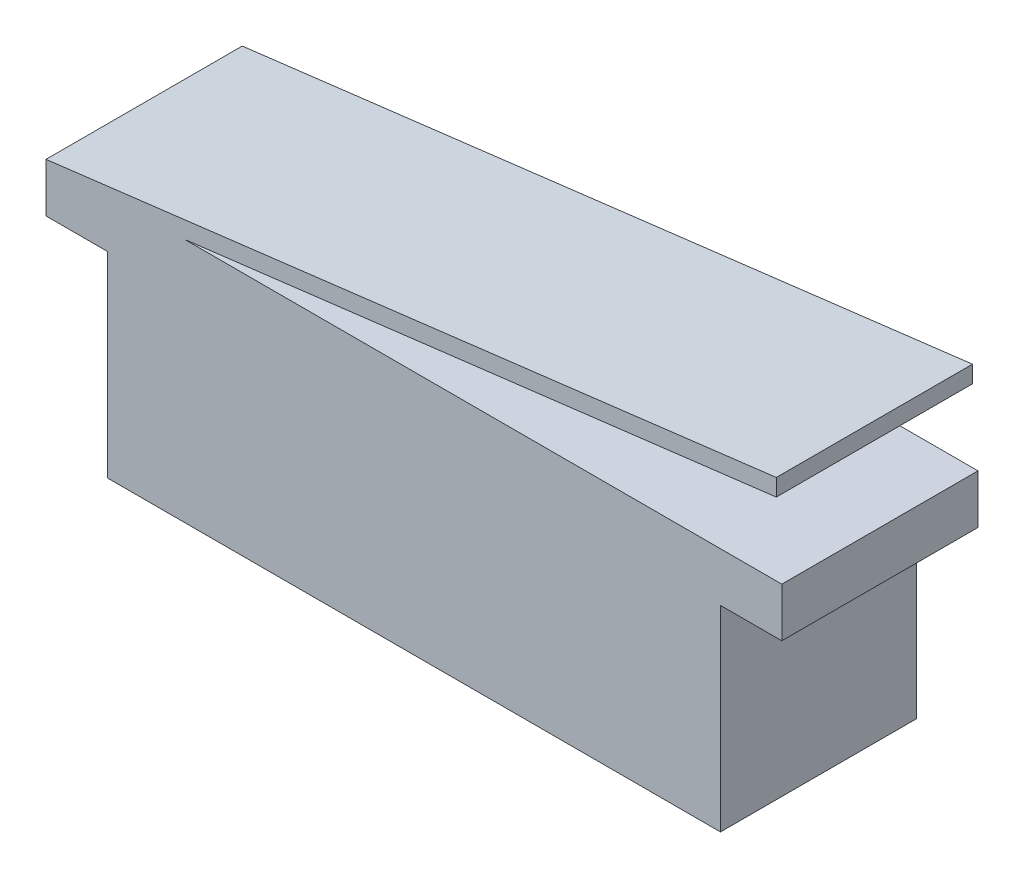
ISO-10303-21;
HEADER;
FILE_DESCRIPTION(('STEP AP214'),'2;1');
FILE_NAME('part.step','',(''),(''),'','','');
FILE_SCHEMA(('AUTOMOTIVE_DESIGN { 1 0 10303 214 1 1 1 1 }'));
ENDSEC;
DATA;
#1=APPLICATION_CONTEXT('core data for automotive mechanical design processes');
#2=APPLICATION_PROTOCOL_DEFINITION('international standard','automotive_design',2000,#1);
#3=PRODUCT_CONTEXT('',#1,'mechanical');
#4=PRODUCT('Part','Part','',(#3));
#5=PRODUCT_RELATED_PRODUCT_CATEGORY('part','',(#4));
#6=PRODUCT_DEFINITION_FORMATION('','',#4);
#7=PRODUCT_DEFINITION_CONTEXT('part definition',#1,'design');
#8=PRODUCT_DEFINITION('design','',#6,#7);
#9=PRODUCT_DEFINITION_SHAPE('','',#8);
#10=(LENGTH_UNIT() NAMED_UNIT(*) SI_UNIT(.MILLI.,.METRE.));
#11=(NAMED_UNIT(*) PLANE_ANGLE_UNIT() SI_UNIT($,.RADIAN.));
#12=(NAMED_UNIT(*) SI_UNIT($,.STERADIAN.) SOLID_ANGLE_UNIT());
#13=UNCERTAINTY_MEASURE_WITH_UNIT(LENGTH_MEASURE(1.E-05),#10,'distance_accuracy_value','');
#14=(GEOMETRIC_REPRESENTATION_CONTEXT(3) GLOBAL_UNCERTAINTY_ASSIGNED_CONTEXT((#13)) GLOBAL_UNIT_ASSIGNED_CONTEXT((#10,
#11,#12)) REPRESENTATION_CONTEXT('',''));
#15=CARTESIAN_POINT('',(0.,0.,0.));
#16=DIRECTION('',(0.,0.,1.));
#17=DIRECTION('',(1.,0.,0.));
#18=AXIS2_PLACEMENT_3D('',#15,#16,#17);
#19=CARTESIAN_POINT('',(14.7763845492397,0.,8.));
#20=DIRECTION('',(1.,0.,0.));
#21=DIRECTION('',(0.,0.,-1.));
#22=AXIS2_PLACEMENT_3D('',#19,#20,#21);
#23=PLANE('',#22);
#24=DIRECTION('',(0.,-1.,0.));
#25=VECTOR('',#24,1.);
#26=CARTESIAN_POINT('',(14.7763845492397,0.,0.));
#27=LINE('',#26,#25);
#28=CARTESIAN_POINT('',(14.7763845492397,9.65608030215444,0.));
#29=VERTEX_POINT('',#28);
#30=CARTESIAN_POINT('',(14.7763845492397,8.96187996174864,0.));
#31=VERTEX_POINT('',#30);
#32=EDGE_CURVE('E159',#29,#31,#27,.T.);
#33=ORIENTED_EDGE('',*,*,#32,.F.);
#34=DIRECTION('',(0.,0.,-1.));
#35=VECTOR('',#34,1.);
#36=CARTESIAN_POINT('',(14.7763845492397,9.65608030215444,8.));
#37=LINE('',#36,#35);
#38=CARTESIAN_POINT('',(14.7763845492397,9.65608030215444,8.));
#39=VERTEX_POINT('',#38);
#40=EDGE_CURVE('E11',#39,#29,#37,.T.);
#41=ORIENTED_EDGE('',*,*,#40,.F.);
#42=DIRECTION('',(0.,-1.,0.));
#43=VECTOR('',#42,1.);
#44=CARTESIAN_POINT('',(14.7763845492397,0.,8.));
#45=LINE('',#44,#43);
#46=CARTESIAN_POINT('',(14.7763845492397,8.96187996174864,8.));
#47=VERTEX_POINT('',#46);
#48=EDGE_CURVE('E194',#39,#47,#45,.T.);
#49=ORIENTED_EDGE('',*,*,#48,.T.);
#50=DIRECTION('',(0.,0.,-1.));
#51=VECTOR('',#50,1.);
#52=CARTESIAN_POINT('',(14.7763845492397,8.96187996174864,8.));
#53=LINE('',#52,#51);
#54=EDGE_CURVE('E103',#47,#31,#53,.T.);
#55=ORIENTED_EDGE('',*,*,#54,.T.);
#56=EDGE_LOOP('',(#33,#41,#49,#55));
#57=FACE_BOUND('',#56,.T.);
#58=ADVANCED_FACE('F43',(#57),#23,.T.);
#59=CARTESIAN_POINT('',(-0.948547739729034,7.7253013958255,8.));
#60=DIRECTION('',(-0.121869343405148,0.992546151641322,0.));
#61=DIRECTION('',(-0.992546151641322,-0.121869343405148,0.));
#62=AXIS2_PLACEMENT_3D('',#59,#60,#61);
#63=PLANE('',#62);
#64=DIRECTION('',(0.992546151641322,0.121869343405148,0.));
#65=VECTOR('',#64,1.);
#66=CARTESIAN_POINT('',(-0.948547739729034,7.7253013958255,0.));
#67=LINE('',#66,#65);
#68=CARTESIAN_POINT('',(-14.9999999999999,6.,0.));
#69=VERTEX_POINT('',#68);
#70=EDGE_CURVE('E163',#69,#29,#67,.T.);
#71=ORIENTED_EDGE('',*,*,#70,.F.);
#72=DIRECTION('',(0.,0.,-1.));
#73=VECTOR('',#72,1.);
#74=CARTESIAN_POINT('',(-14.9999999999999,6.,8.));
#75=LINE('',#74,#73);
#76=CARTESIAN_POINT('',(-14.9999999999999,6.,8.));
#77=VERTEX_POINT('',#76);
#78=EDGE_CURVE('E52',#77,#69,#75,.T.);
#79=ORIENTED_EDGE('',*,*,#78,.F.);
#80=DIRECTION('',(0.992546151641322,0.121869343405148,0.));
#81=VECTOR('',#80,1.);
#82=CARTESIAN_POINT('',(-0.948547739729034,7.7253013958255,8.));
#83=LINE('',#82,#81);
#84=EDGE_CURVE('E244',#77,#39,#83,.T.);
#85=ORIENTED_EDGE('',*,*,#84,.T.);
#86=ORIENTED_EDGE('',*,*,#40,.T.);
#87=EDGE_LOOP('',(#71,#79,#85,#86));
#88=FACE_BOUND('',#87,.T.);
#89=ADVANCED_FACE('F228',(#88),#63,.T.);
#90=CARTESIAN_POINT('',(-14.9999999999999,0.,8.));
#91=DIRECTION('',(-1.,0.,0.));
#92=DIRECTION('',(0.,0.,1.));
#93=AXIS2_PLACEMENT_3D('',#90,#91,#92);
#94=PLANE('',#93);
#95=DIRECTION('',(0.,1.,0.));
#96=VECTOR('',#95,1.);
#97=CARTESIAN_POINT('',(-14.9999999999999,0.,0.));
#98=LINE('',#97,#96);
#99=CARTESIAN_POINT('',(-14.9999999999999,4.,0.));
#100=VERTEX_POINT('',#99);
#101=EDGE_CURVE('E167',#100,#69,#98,.T.);
#102=ORIENTED_EDGE('',*,*,#101,.F.);
#103=DIRECTION('',(0.,0.,-1.));
#104=VECTOR('',#103,1.);
#105=CARTESIAN_POINT('',(-14.9999999999999,4.,8.));
#106=LINE('',#105,#104);
#107=CARTESIAN_POINT('',(-14.9999999999999,4.,8.));
#108=VERTEX_POINT('',#107);
#109=EDGE_CURVE('E215',#108,#100,#106,.T.);
#110=ORIENTED_EDGE('',*,*,#109,.F.);
#111=DIRECTION('',(0.,1.,0.));
#112=VECTOR('',#111,1.);
#113=CARTESIAN_POINT('',(-14.9999999999999,0.,8.));
#114=LINE('',#113,#112);
#115=EDGE_CURVE('E224',#108,#77,#114,.T.);
#116=ORIENTED_EDGE('',*,*,#115,.T.);
#117=ORIENTED_EDGE('',*,*,#78,.T.);
#118=EDGE_LOOP('',(#102,#110,#116,#117));
#119=FACE_BOUND('',#118,.T.);
#120=ADVANCED_FACE('F222',(#119),#94,.T.);
#121=CARTESIAN_POINT('',(0.,4.,8.));
#122=DIRECTION('',(0.,1.,0.));
#123=DIRECTION('',(0.,0.,1.));
#124=AXIS2_PLACEMENT_3D('',#121,#122,#123);
#125=PLANE('',#124);
#126=DIRECTION('',(1.,0.,0.));
#127=VECTOR('',#126,1.);
#128=CARTESIAN_POINT('',(0.,4.,0.));
#129=LINE('',#128,#127);
#130=CARTESIAN_POINT('',(-12.5,4.,0.));
#131=VERTEX_POINT('',#130);
#132=EDGE_CURVE('E171',#100,#131,#129,.T.);
#133=ORIENTED_EDGE('',*,*,#132,.T.);
#134=DIRECTION('',(0.,0.,-1.));
#135=VECTOR('',#134,1.);
#136=CARTESIAN_POINT('',(-12.5,4.,8.));
#137=LINE('',#136,#135);
#138=CARTESIAN_POINT('',(-12.5,4.,8.));
#139=VERTEX_POINT('',#138);
#140=EDGE_CURVE('E212',#139,#131,#137,.T.);
#141=ORIENTED_EDGE('',*,*,#140,.F.);
#142=DIRECTION('',(1.,0.,0.));
#143=VECTOR('',#142,1.);
#144=CARTESIAN_POINT('',(0.,4.,8.));
#145=LINE('',#144,#143);
#146=EDGE_CURVE('E239',#108,#139,#145,.T.);
#147=ORIENTED_EDGE('',*,*,#146,.F.);
#148=ORIENTED_EDGE('',*,*,#109,.T.);
#149=EDGE_LOOP('',(#133,#141,#147,#148));
#150=FACE_BOUND('',#149,.T.);
#151=ADVANCED_FACE('F236',(#150),#125,.F.);
#152=CARTESIAN_POINT('',(-12.5,0.,8.));
#153=DIRECTION('',(-1.,0.,0.));
#154=DIRECTION('',(0.,0.,1.));
#155=AXIS2_PLACEMENT_3D('',#152,#153,#154);
#156=PLANE('',#155);
#157=DIRECTION('',(0.,1.,0.));
#158=VECTOR('',#157,1.);
#159=CARTESIAN_POINT('',(-12.5,0.,0.));
#160=LINE('',#159,#158);
#161=CARTESIAN_POINT('',(-12.5,-4.,0.));
#162=VERTEX_POINT('',#161);
#163=EDGE_CURVE('E175',#162,#131,#160,.T.);
#164=ORIENTED_EDGE('',*,*,#163,.F.);
#165=DIRECTION('',(0.,0.,-1.));
#166=VECTOR('',#165,1.);
#167=CARTESIAN_POINT('',(-12.5,-4.,8.));
#168=LINE('',#167,#166);
#169=CARTESIAN_POINT('',(-12.5,-4.,8.));
#170=VERTEX_POINT('',#169);
#171=EDGE_CURVE('E209',#170,#162,#168,.T.);
#172=ORIENTED_EDGE('',*,*,#171,.F.);
#173=DIRECTION('',(0.,1.,0.));
#174=VECTOR('',#173,1.);
#175=CARTESIAN_POINT('',(-12.5,0.,8.));
#176=LINE('',#175,#174);
#177=EDGE_CURVE('E242',#170,#139,#176,.T.);
#178=ORIENTED_EDGE('',*,*,#177,.T.);
#179=ORIENTED_EDGE('',*,*,#140,.T.);
#180=EDGE_LOOP('',(#164,#172,#178,#179));
#181=FACE_BOUND('',#180,.T.);
#182=ADVANCED_FACE('F280',(#181),#156,.T.);
#183=CARTESIAN_POINT('',(0.,-4.,8.));
#184=DIRECTION('',(0.,1.,0.));
#185=DIRECTION('',(0.,0.,1.));
#186=AXIS2_PLACEMENT_3D('',#183,#184,#185);
#187=PLANE('',#186);
#188=DIRECTION('',(1.,0.,0.));
#189=VECTOR('',#188,1.);
#190=CARTESIAN_POINT('',(0.,-4.,0.));
#191=LINE('',#190,#189);
#192=CARTESIAN_POINT('',(12.5000000000001,-4.,0.));
#193=VERTEX_POINT('',#192);
#194=EDGE_CURVE('E180',#162,#193,#191,.T.);
#195=ORIENTED_EDGE('',*,*,#194,.T.);
#196=DIRECTION('',(0.,0.,-1.));
#197=VECTOR('',#196,1.);
#198=CARTESIAN_POINT('',(12.5000000000001,-4.,8.));
#199=LINE('',#198,#197);
#200=CARTESIAN_POINT('',(12.5000000000001,-4.,8.));
#201=VERTEX_POINT('',#200);
#202=EDGE_CURVE('E205',#201,#193,#199,.T.);
#203=ORIENTED_EDGE('',*,*,#202,.F.);
#204=DIRECTION('',(1.,0.,0.));
#205=VECTOR('',#204,1.);
#206=CARTESIAN_POINT('',(0.,-4.,8.));
#207=LINE('',#206,#205);
#208=EDGE_CURVE('E253',#170,#201,#207,.T.);
#209=ORIENTED_EDGE('',*,*,#208,.F.);
#210=ORIENTED_EDGE('',*,*,#171,.T.);
#211=EDGE_LOOP('',(#195,#203,#209,#210));
#212=FACE_BOUND('',#211,.T.);
#213=ADVANCED_FACE('F283',(#212),#187,.F.);
#214=CARTESIAN_POINT('',(12.5000000000001,0.,8.));
#215=DIRECTION('',(-1.,0.,0.));
#216=DIRECTION('',(0.,0.,1.));
#217=AXIS2_PLACEMENT_3D('',#214,#215,#216);
#218=PLANE('',#217);
#219=DIRECTION('',(0.,1.,0.));
#220=VECTOR('',#219,1.);
#221=CARTESIAN_POINT('',(12.5000000000001,0.,0.));
#222=LINE('',#221,#220);
#223=CARTESIAN_POINT('',(12.5000000000001,4.,0.));
#224=VERTEX_POINT('',#223);
#225=EDGE_CURVE('E183',#193,#224,#222,.T.);
#226=ORIENTED_EDGE('',*,*,#225,.T.);
#227=DIRECTION('',(0.,0.,-1.));
#228=VECTOR('',#227,1.);
#229=CARTESIAN_POINT('',(12.5000000000001,4.,8.));
#230=LINE('',#229,#228);
#231=CARTESIAN_POINT('',(12.5000000000001,4.,8.));
#232=VERTEX_POINT('',#231);
#233=EDGE_CURVE('E201',#232,#224,#230,.T.);
#234=ORIENTED_EDGE('',*,*,#233,.F.);
#235=DIRECTION('',(0.,1.,0.));
#236=VECTOR('',#235,1.);
#237=CARTESIAN_POINT('',(12.5000000000001,0.,8.));
#238=LINE('',#237,#236);
#239=EDGE_CURVE('E255',#201,#232,#238,.T.);
#240=ORIENTED_EDGE('',*,*,#239,.F.);
#241=ORIENTED_EDGE('',*,*,#202,.T.);
#242=EDGE_LOOP('',(#226,#234,#240,#241));
#243=FACE_BOUND('',#242,.T.);
#244=ADVANCED_FACE('F263',(#243),#218,.F.);
#245=CARTESIAN_POINT('',(15.0000000000001,4.,0.));
#246=VERTEX_POINT('',#245);
#247=EDGE_CURVE('E176',#224,#246,#129,.T.);
#248=ORIENTED_EDGE('',*,*,#247,.T.);
#249=DIRECTION('',(0.,0.,-1.));
#250=VECTOR('',#249,1.);
#251=CARTESIAN_POINT('',(15.0000000000001,4.,8.));
#252=LINE('',#251,#250);
#253=CARTESIAN_POINT('',(15.0000000000001,4.,8.));
#254=VERTEX_POINT('',#253);
#255=EDGE_CURVE('E150',#254,#246,#252,.T.);
#256=ORIENTED_EDGE('',*,*,#255,.F.);
#257=EDGE_CURVE('E135',#232,#254,#145,.T.);
#258=ORIENTED_EDGE('',*,*,#257,.F.);
#259=ORIENTED_EDGE('',*,*,#233,.T.);
#260=EDGE_LOOP('',(#248,#256,#258,#259));
#261=FACE_BOUND('',#260,.T.);
#262=ADVANCED_FACE('F267',(#261),#125,.F.);
#263=CARTESIAN_POINT('',(15.0000000000001,0.,8.));
#264=DIRECTION('',(-1.,0.,0.));
#265=DIRECTION('',(0.,0.,1.));
#266=AXIS2_PLACEMENT_3D('',#263,#264,#265);
#267=PLANE('',#266);
#268=DIRECTION('',(0.,1.,0.));
#269=VECTOR('',#268,1.);
#270=CARTESIAN_POINT('',(15.0000000000001,0.,0.));
#271=LINE('',#270,#269);
#272=CARTESIAN_POINT('',(15.0000000000001,6.,0.));
#273=VERTEX_POINT('',#272);
#274=EDGE_CURVE('E145',#246,#273,#271,.T.);
#275=ORIENTED_EDGE('',*,*,#274,.T.);
#276=DIRECTION('',(0.,0.,-1.));
#277=VECTOR('',#276,1.);
#278=CARTESIAN_POINT('',(15.0000000000001,6.,8.));
#279=LINE('',#278,#277);
#280=CARTESIAN_POINT('',(15.0000000000001,6.,8.));
#281=VERTEX_POINT('',#280);
#282=EDGE_CURVE('E142',#281,#273,#279,.T.);
#283=ORIENTED_EDGE('',*,*,#282,.F.);
#284=DIRECTION('',(0.,1.,0.));
#285=VECTOR('',#284,1.);
#286=CARTESIAN_POINT('',(15.0000000000001,0.,8.));
#287=LINE('',#286,#285);
#288=EDGE_CURVE('E129',#254,#281,#287,.T.);
#289=ORIENTED_EDGE('',*,*,#288,.F.);
#290=ORIENTED_EDGE('',*,*,#255,.T.);
#291=EDGE_LOOP('',(#275,#283,#289,#290));
#292=FACE_BOUND('',#291,.T.);
#293=ADVANCED_FACE('F143',(#292),#267,.F.);
#294=CARTESIAN_POINT('',(0.,6.,8.));
#295=DIRECTION('',(0.,1.,0.));
#296=DIRECTION('',(0.,0.,1.));
#297=AXIS2_PLACEMENT_3D('',#294,#295,#296);
#298=PLANE('',#297);
#299=DIRECTION('',(1.,0.,0.));
#300=VECTOR('',#299,1.);
#301=CARTESIAN_POINT('',(0.,6.,0.));
#302=LINE('',#301,#300);
#303=CARTESIAN_POINT('',(-9.34619193731727,6.,0.));
#304=VERTEX_POINT('',#303);
#305=EDGE_CURVE('E188',#304,#273,#302,.T.);
#306=ORIENTED_EDGE('',*,*,#305,.F.);
#307=DIRECTION('',(0.,0.,-1.));
#308=VECTOR('',#307,1.);
#309=CARTESIAN_POINT('',(-9.34619193731727,6.,8.));
#310=LINE('',#309,#308);
#311=CARTESIAN_POINT('',(-9.34619193731727,6.,8.));
#312=VERTEX_POINT('',#311);
#313=EDGE_CURVE('E96',#312,#304,#310,.T.);
#314=ORIENTED_EDGE('',*,*,#313,.F.);
#315=DIRECTION('',(1.,0.,0.));
#316=VECTOR('',#315,1.);
#317=CARTESIAN_POINT('',(0.,6.,8.));
#318=LINE('',#317,#316);
#319=EDGE_CURVE('E133',#312,#281,#318,.T.);
#320=ORIENTED_EDGE('',*,*,#319,.T.);
#321=ORIENTED_EDGE('',*,*,#282,.T.);
#322=EDGE_LOOP('',(#306,#314,#320,#321));
#323=FACE_BOUND('',#322,.T.);
#324=ADVANCED_FACE('F152',(#323),#298,.T.);
#325=CARTESIAN_POINT('',(-0.86457660859058,7.04141141388505,8.));
#326=DIRECTION('',(-0.121869343405148,0.992546151641322,0.));
#327=DIRECTION('',(-0.992546151641322,-0.121869343405148,0.));
#328=AXIS2_PLACEMENT_3D('',#325,#326,#327);
#329=PLANE('',#328);
#330=DIRECTION('',(0.992546151641322,0.121869343405148,0.));
#331=VECTOR('',#330,1.);
#332=CARTESIAN_POINT('',(-0.86457660859058,7.04141141388505,0.));
#333=LINE('',#332,#331);
#334=EDGE_CURVE('E191',#304,#31,#333,.T.);
#335=ORIENTED_EDGE('',*,*,#334,.T.);
#336=ORIENTED_EDGE('',*,*,#54,.F.);
#337=DIRECTION('',(0.992546151641322,0.121869343405148,0.));
#338=VECTOR('',#337,1.);
#339=CARTESIAN_POINT('',(-0.86457660859058,7.04141141388505,8.));
#340=LINE('',#339,#338);
#341=EDGE_CURVE('E60',#312,#47,#340,.T.);
#342=ORIENTED_EDGE('',*,*,#341,.F.);
#343=ORIENTED_EDGE('',*,*,#313,.T.);
#344=EDGE_LOOP('',(#335,#336,#342,#343));
#345=FACE_BOUND('',#344,.T.);
#346=ADVANCED_FACE('F268',(#345),#329,.F.);
#347=CARTESIAN_POINT('',(0.,0.,8.));
#348=DIRECTION('',(0.,0.,1.));
#349=DIRECTION('',(1.,0.,0.));
#350=AXIS2_PLACEMENT_3D('',#347,#348,#349);
#351=PLANE('',#350);
#352=ORIENTED_EDGE('',*,*,#48,.F.);
#353=ORIENTED_EDGE('',*,*,#84,.F.);
#354=ORIENTED_EDGE('',*,*,#115,.F.);
#355=ORIENTED_EDGE('',*,*,#146,.T.);
#356=ORIENTED_EDGE('',*,*,#177,.F.);
#357=ORIENTED_EDGE('',*,*,#208,.T.);
#358=ORIENTED_EDGE('',*,*,#239,.T.);
#359=ORIENTED_EDGE('',*,*,#257,.T.);
#360=ORIENTED_EDGE('',*,*,#288,.T.);
#361=ORIENTED_EDGE('',*,*,#319,.F.);
#362=ORIENTED_EDGE('',*,*,#341,.T.);
#363=EDGE_LOOP('',(#352,#353,#354,#355,#356,#357,#358,#359,#360,#361,#362));
#364=FACE_BOUND('',#363,.T.);
#365=ADVANCED_FACE('F131',(#364),#351,.T.);
#366=CARTESIAN_POINT('',(0.,0.,0.));
#367=DIRECTION('',(0.,0.,1.));
#368=DIRECTION('',(1.,0.,0.));
#369=AXIS2_PLACEMENT_3D('',#366,#367,#368);
#370=PLANE('',#369);
#371=ORIENTED_EDGE('',*,*,#32,.T.);
#372=ORIENTED_EDGE('',*,*,#334,.F.);
#373=ORIENTED_EDGE('',*,*,#305,.T.);
#374=ORIENTED_EDGE('',*,*,#274,.F.);
#375=ORIENTED_EDGE('',*,*,#247,.F.);
#376=ORIENTED_EDGE('',*,*,#225,.F.);
#377=ORIENTED_EDGE('',*,*,#194,.F.);
#378=ORIENTED_EDGE('',*,*,#163,.T.);
#379=ORIENTED_EDGE('',*,*,#132,.F.);
#380=ORIENTED_EDGE('',*,*,#101,.T.);
#381=ORIENTED_EDGE('',*,*,#70,.T.);
#382=EDGE_LOOP('',(#371,#372,#373,#374,#375,#376,#377,#378,#379,#380,#381));
#383=FACE_BOUND('',#382,.T.);
#384=ADVANCED_FACE('F231',(#383),#370,.F.);
#385=CLOSED_SHELL('',(#58,#89,#120,#151,#182,#213,#244,#262,#293,#324,#346,#365,#384));
#386=MANIFOLD_SOLID_BREP('B2',#385);
#387=ADVANCED_BREP_SHAPE_REPRESENTATION('',(#18,#386),#14);
#388=SHAPE_DEFINITION_REPRESENTATION(#9,#387);
ENDSEC;
END-ISO-10303-21;
